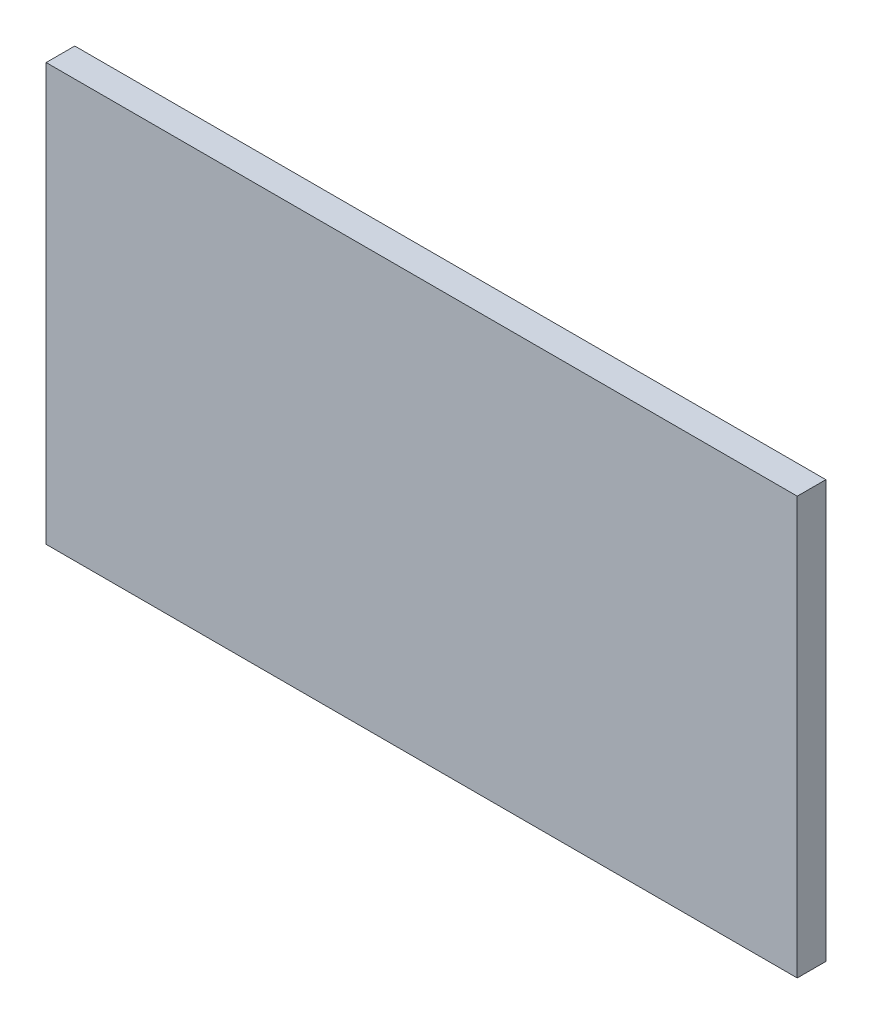
ISO-10303-21;
HEADER;
FILE_DESCRIPTION(('STEP AP214'),'2;1');
FILE_NAME('part.step','',(''),(''),'','','');
FILE_SCHEMA(('AUTOMOTIVE_DESIGN { 1 0 10303 214 1 1 1 1 }'));
ENDSEC;
DATA;
#1=APPLICATION_CONTEXT('core data for automotive mechanical design processes');
#2=APPLICATION_PROTOCOL_DEFINITION('international standard','automotive_design',2000,#1);
#3=PRODUCT_CONTEXT('',#1,'mechanical');
#4=PRODUCT('Part','Part','',(#3));
#5=PRODUCT_RELATED_PRODUCT_CATEGORY('part','',(#4));
#6=PRODUCT_DEFINITION_FORMATION('','',#4);
#7=PRODUCT_DEFINITION_CONTEXT('part definition',#1,'design');
#8=PRODUCT_DEFINITION('design','',#6,#7);
#9=PRODUCT_DEFINITION_SHAPE('','',#8);
#10=(LENGTH_UNIT() NAMED_UNIT(*) SI_UNIT(.MILLI.,.METRE.));
#11=(NAMED_UNIT(*) PLANE_ANGLE_UNIT() SI_UNIT($,.RADIAN.));
#12=(NAMED_UNIT(*) SI_UNIT($,.STERADIAN.) SOLID_ANGLE_UNIT());
#13=UNCERTAINTY_MEASURE_WITH_UNIT(LENGTH_MEASURE(1.E-05),#10,'distance_accuracy_value','');
#14=(GEOMETRIC_REPRESENTATION_CONTEXT(3) GLOBAL_UNCERTAINTY_ASSIGNED_CONTEXT((#13)) GLOBAL_UNIT_ASSIGNED_CONTEXT((#10,
#11,#12)) REPRESENTATION_CONTEXT('',''));
#15=CARTESIAN_POINT('',(0.,0.,0.));
#16=DIRECTION('',(0.,0.,1.));
#17=DIRECTION('',(1.,0.,0.));
#18=AXIS2_PLACEMENT_3D('',#15,#16,#17);
#19=CARTESIAN_POINT('',(12.50008,8.8,0.));
#20=DIRECTION('',(0.,0.,-1.));
#21=DIRECTION('',(-1.,0.,0.));
#22=AXIS2_PLACEMENT_3D('',#19,#20,#21);
#23=PLANE('',#22);
#24=DIRECTION('',(1.,0.,0.));
#25=VECTOR('',#24,1.);
#26=CARTESIAN_POINT('',(12.05008,9.05,0.));
#27=LINE('',#26,#25);
#28=CARTESIAN_POINT('',(12.05008,9.05,0.));
#29=VERTEX_POINT('',#28);
#30=CARTESIAN_POINT('',(12.95008,9.05,0.));
#31=VERTEX_POINT('',#30);
#32=EDGE_CURVE('E55',#29,#31,#27,.T.);
#33=ORIENTED_EDGE('',*,*,#32,.T.);
#34=DIRECTION('',(0.,1.,0.));
#35=VECTOR('',#34,1.);
#36=CARTESIAN_POINT('',(12.95008,9.05,0.));
#37=LINE('',#36,#35);
#38=CARTESIAN_POINT('',(12.95008,8.55,0.));
#39=VERTEX_POINT('',#38);
#40=EDGE_CURVE('E57',#31,#39,#37,.F.);
#41=ORIENTED_EDGE('',*,*,#40,.T.);
#42=DIRECTION('',(1.,0.,0.));
#43=VECTOR('',#42,1.);
#44=CARTESIAN_POINT('',(12.95008,8.55,0.));
#45=LINE('',#44,#43);
#46=CARTESIAN_POINT('',(12.05008,8.55,0.));
#47=VERTEX_POINT('',#46);
#48=EDGE_CURVE('E20',#39,#47,#45,.F.);
#49=ORIENTED_EDGE('',*,*,#48,.T.);
#50=DIRECTION('',(0.,1.,0.));
#51=VECTOR('',#50,1.);
#52=CARTESIAN_POINT('',(12.05008,8.55,0.));
#53=LINE('',#52,#51);
#54=EDGE_CURVE('E80',#47,#29,#53,.T.);
#55=ORIENTED_EDGE('',*,*,#54,.T.);
#56=EDGE_LOOP('',(#33,#41,#49,#55));
#57=FACE_BOUND('',#56,.T.);
#58=ADVANCED_FACE('F17',(#57),#23,.T.);
#59=CARTESIAN_POINT('',(12.95008,8.55,0.));
#60=DIRECTION('',(0.,1.,0.));
#61=DIRECTION('',(0.,0.,1.));
#62=AXIS2_PLACEMENT_3D('',#59,#60,#61);
#63=PLANE('',#62);
#64=DIRECTION('',(0.,0.,-1.));
#65=VECTOR('',#64,1.);
#66=CARTESIAN_POINT('',(12.05008,8.55,0.));
#67=LINE('',#66,#65);
#68=CARTESIAN_POINT('',(12.05008,8.55,0.03429));
#69=VERTEX_POINT('',#68);
#70=EDGE_CURVE('E68',#69,#47,#67,.T.);
#71=ORIENTED_EDGE('',*,*,#70,.T.);
#72=ORIENTED_EDGE('',*,*,#48,.F.);
#73=DIRECTION('',(0.,0.,1.));
#74=VECTOR('',#73,1.);
#75=CARTESIAN_POINT('',(12.95008,8.55,0.));
#76=LINE('',#75,#74);
#77=CARTESIAN_POINT('',(12.95008,8.55,0.03429));
#78=VERTEX_POINT('',#77);
#79=EDGE_CURVE('E63',#39,#78,#76,.T.);
#80=ORIENTED_EDGE('',*,*,#79,.T.);
#81=DIRECTION('',(1.,0.,0.));
#82=VECTOR('',#81,1.);
#83=CARTESIAN_POINT('',(12.50008,8.55,0.03429));
#84=LINE('',#83,#82);
#85=EDGE_CURVE('E83',#69,#78,#84,.T.);
#86=ORIENTED_EDGE('',*,*,#85,.F.);
#87=EDGE_LOOP('',(#71,#72,#80,#86));
#88=FACE_BOUND('',#87,.T.);
#89=ADVANCED_FACE('F65',(#88),#63,.F.);
#90=CARTESIAN_POINT('',(12.95008,9.05,0.));
#91=DIRECTION('',(-1.,0.,0.));
#92=DIRECTION('',(0.,0.,1.));
#93=AXIS2_PLACEMENT_3D('',#90,#91,#92);
#94=PLANE('',#93);
#95=ORIENTED_EDGE('',*,*,#79,.F.);
#96=ORIENTED_EDGE('',*,*,#40,.F.);
#97=DIRECTION('',(0.,0.,-1.));
#98=VECTOR('',#97,1.);
#99=CARTESIAN_POINT('',(12.95008,9.05,0.));
#100=LINE('',#99,#98);
#101=CARTESIAN_POINT('',(12.95008,9.05,0.03429));
#102=VERTEX_POINT('',#101);
#103=EDGE_CURVE('E75',#31,#102,#100,.F.);
#104=ORIENTED_EDGE('',*,*,#103,.T.);
#105=DIRECTION('',(0.,1.,0.));
#106=VECTOR('',#105,1.);
#107=CARTESIAN_POINT('',(12.95008,8.8,0.03429));
#108=LINE('',#107,#106);
#109=EDGE_CURVE('E72',#78,#102,#108,.T.);
#110=ORIENTED_EDGE('',*,*,#109,.F.);
#111=EDGE_LOOP('',(#95,#96,#104,#110));
#112=FACE_BOUND('',#111,.T.);
#113=ADVANCED_FACE('F70',(#112),#94,.F.);
#114=CARTESIAN_POINT('',(12.05008,9.05,0.));
#115=DIRECTION('',(0.,-1.,0.));
#116=DIRECTION('',(0.,0.,-1.));
#117=AXIS2_PLACEMENT_3D('',#114,#115,#116);
#118=PLANE('',#117);
#119=ORIENTED_EDGE('',*,*,#103,.F.);
#120=ORIENTED_EDGE('',*,*,#32,.F.);
#121=DIRECTION('',(0.,0.,-1.));
#122=VECTOR('',#121,1.);
#123=CARTESIAN_POINT('',(12.05008,9.05,0.));
#124=LINE('',#123,#122);
#125=CARTESIAN_POINT('',(12.05008,9.05,0.03429));
#126=VERTEX_POINT('',#125);
#127=EDGE_CURVE('E35',#29,#126,#124,.F.);
#128=ORIENTED_EDGE('',*,*,#127,.T.);
#129=DIRECTION('',(1.,0.,0.));
#130=VECTOR('',#129,1.);
#131=CARTESIAN_POINT('',(12.50008,9.05,0.03429));
#132=LINE('',#131,#130);
#133=EDGE_CURVE('E26',#102,#126,#132,.F.);
#134=ORIENTED_EDGE('',*,*,#133,.F.);
#135=EDGE_LOOP('',(#119,#120,#128,#134));
#136=FACE_BOUND('',#135,.T.);
#137=ADVANCED_FACE('F89',(#136),#118,.F.);
#138=CARTESIAN_POINT('',(12.05008,8.55,0.));
#139=DIRECTION('',(1.,0.,0.));
#140=DIRECTION('',(0.,0.,-1.));
#141=AXIS2_PLACEMENT_3D('',#138,#139,#140);
#142=PLANE('',#141);
#143=ORIENTED_EDGE('',*,*,#127,.F.);
#144=ORIENTED_EDGE('',*,*,#54,.F.);
#145=ORIENTED_EDGE('',*,*,#70,.F.);
#146=DIRECTION('',(0.,1.,0.));
#147=VECTOR('',#146,1.);
#148=CARTESIAN_POINT('',(12.05008,8.8,0.03429));
#149=LINE('',#148,#147);
#150=EDGE_CURVE('E11',#126,#69,#149,.F.);
#151=ORIENTED_EDGE('',*,*,#150,.F.);
#152=EDGE_LOOP('',(#143,#144,#145,#151));
#153=FACE_BOUND('',#152,.T.);
#154=ADVANCED_FACE('F91',(#153),#142,.F.);
#155=CARTESIAN_POINT('',(12.50008,8.8,0.03429));
#156=DIRECTION('',(0.,0.,1.));
#157=DIRECTION('',(1.,0.,0.));
#158=AXIS2_PLACEMENT_3D('',#155,#156,#157);
#159=PLANE('',#158);
#160=ORIENTED_EDGE('',*,*,#133,.T.);
#161=ORIENTED_EDGE('',*,*,#150,.T.);
#162=ORIENTED_EDGE('',*,*,#85,.T.);
#163=ORIENTED_EDGE('',*,*,#109,.T.);
#164=EDGE_LOOP('',(#160,#161,#162,#163));
#165=FACE_BOUND('',#164,.T.);
#166=ADVANCED_FACE('F88',(#165),#159,.T.);
#167=CLOSED_SHELL('',(#58,#89,#113,#137,#154,#166));
#168=MANIFOLD_SOLID_BREP('B1',#167);
#169=ADVANCED_BREP_SHAPE_REPRESENTATION('',(#18,#168),#14);
#170=SHAPE_DEFINITION_REPRESENTATION(#9,#169);
ENDSEC;
END-ISO-10303-21;
